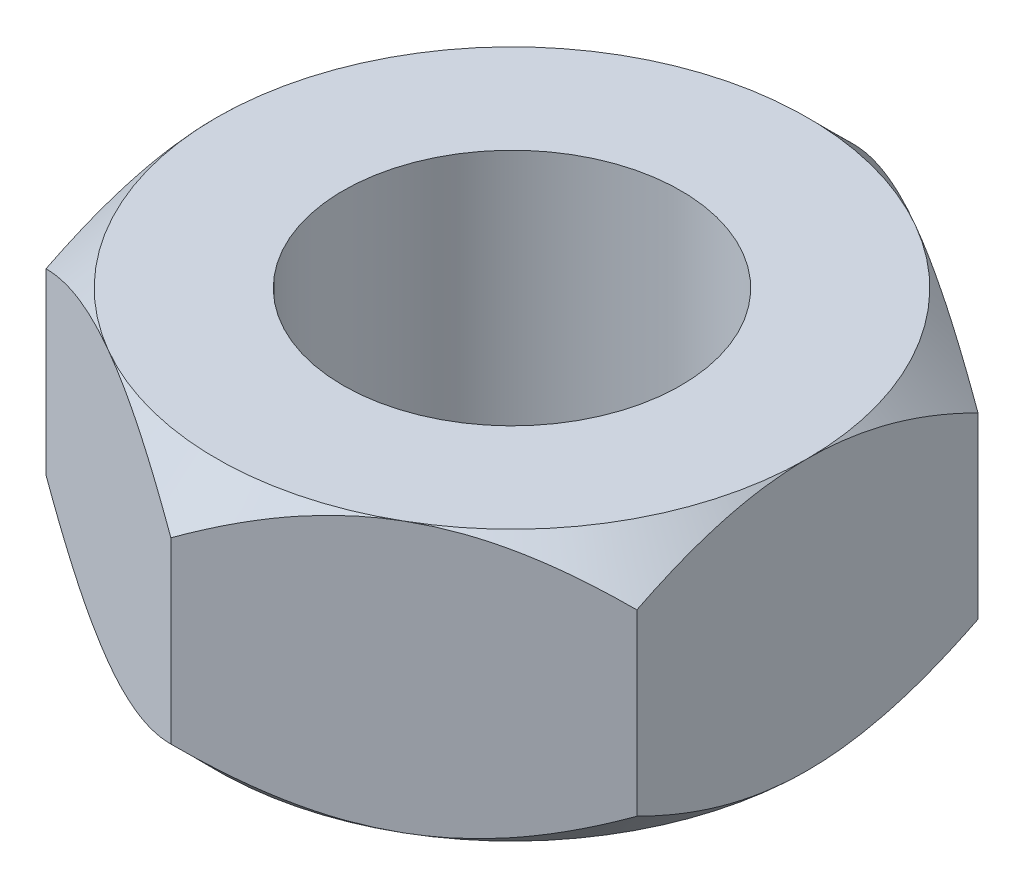
ISO-10303-21;
HEADER;
FILE_DESCRIPTION(('STEP AP214'),'2;1');
FILE_NAME('part.step','',(''),(''),'','','');
FILE_SCHEMA(('AUTOMOTIVE_DESIGN { 1 0 10303 214 1 1 1 1 }'));
ENDSEC;
DATA;
#1=APPLICATION_CONTEXT('core data for automotive mechanical design processes');
#2=APPLICATION_PROTOCOL_DEFINITION('international standard','automotive_design',2000,#1);
#3=PRODUCT_CONTEXT('',#1,'mechanical');
#4=PRODUCT('Part','Part','',(#3));
#5=PRODUCT_RELATED_PRODUCT_CATEGORY('part','',(#4));
#6=PRODUCT_DEFINITION_FORMATION('','',#4);
#7=PRODUCT_DEFINITION_CONTEXT('part definition',#1,'design');
#8=PRODUCT_DEFINITION('design','',#6,#7);
#9=PRODUCT_DEFINITION_SHAPE('','',#8);
#10=(LENGTH_UNIT() NAMED_UNIT(*) SI_UNIT(.MILLI.,.METRE.));
#11=(NAMED_UNIT(*) PLANE_ANGLE_UNIT() SI_UNIT($,.RADIAN.));
#12=(NAMED_UNIT(*) SI_UNIT($,.STERADIAN.) SOLID_ANGLE_UNIT());
#13=UNCERTAINTY_MEASURE_WITH_UNIT(LENGTH_MEASURE(1.E-05),#10,'distance_accuracy_value','');
#14=(GEOMETRIC_REPRESENTATION_CONTEXT(3) GLOBAL_UNCERTAINTY_ASSIGNED_CONTEXT((#13)) GLOBAL_UNIT_ASSIGNED_CONTEXT((#10,
#11,#12)) REPRESENTATION_CONTEXT('',''));
#15=CARTESIAN_POINT('',(0.,0.,0.));
#16=DIRECTION('',(0.,0.,1.));
#17=DIRECTION('',(1.,0.,0.));
#18=AXIS2_PLACEMENT_3D('',#15,#16,#17);
#19=CARTESIAN_POINT('',(3.5,3.2,-2.02072594216369));
#20=DIRECTION('',(-0.5,0.,0.866025403784439));
#21=DIRECTION('',(0.866025403784439,0.,0.5));
#22=AXIS2_PLACEMENT_3D('',#19,#20,#21);
#23=PLANE('',#22);
#24=CARTESIAN_POINT('',(-0.000200000000000032,0.541567359329792,-4.04156735438122));
#25=CARTESIAN_POINT('',(0.120108757817009,0.472167818058705,-3.9721070606697));
#26=CARTESIAN_POINT('',(0.242429214365459,0.406844363182905,-3.90148531215405));
#27=CARTESIAN_POINT('',(0.491853884911907,0.287238936013908,-3.75747991147153));
#28=CARTESIAN_POINT('',(0.618981816842552,0.23302350720677,-3.68408256574985));
#29=CARTESIAN_POINT('',(0.875329162282525,0.140151559561213,-3.53608035685403));
#30=CARTESIAN_POINT('',(1.00448329914368,0.101261624534898,-3.46151318117029));
#31=CARTESIAN_POINT('',(1.26563479388695,0.0413437887204587,-3.31073729538099));
#32=CARTESIAN_POINT('',(1.39762417499828,0.0202711646750029,-3.2345331906662));
#33=CARTESIAN_POINT('',(1.62510370665134,0.00125799897572972,-3.10319782183117));
#34=CARTESIAN_POINT('',(1.72030010780515,-0.00155641581267458,-3.04823615399913));
#35=CARTESIAN_POINT('',(1.91053805112478,0.00318657176732524,-2.93840222621346));
#36=CARTESIAN_POINT('',(2.00557952731162,0.0107476100843944,-2.88353000435281));
#37=CARTESIAN_POINT('',(2.1947620533761,0.0358097805817826,-2.77430542200351));
#38=CARTESIAN_POINT('',(2.2889019761705,0.0533220307074887,-2.71995371223668));
#39=CARTESIAN_POINT('',(2.47556499941577,0.0973307817217027,-2.61218376551827));
#40=CARTESIAN_POINT('',(2.56808822325596,0.123826593791727,-2.55876545732784));
#41=CARTESIAN_POINT('',(2.73234167964216,0.178339853761708,-2.46393368006795));
#42=CARTESIAN_POINT('',(2.80443551971228,0.204924188177154,-2.42231028209655));
#43=CARTESIAN_POINT('',(2.9473289397123,0.262377259290712,-2.33981072759411));
#44=CARTESIAN_POINT('',(3.01812848014492,0.293246126490849,-2.29893459386683));
#45=CARTESIAN_POINT('',(3.15821024645785,0.358576224971511,-2.21805834837751));
#46=CARTESIAN_POINT('',(3.22749645656528,0.393026159978349,-2.17805593632085));
#47=CARTESIAN_POINT('',(3.36478573118621,0.465065984042715,-2.09879193666161));
#48=CARTESIAN_POINT('',(3.43278955208019,0.502653946387927,-2.05952991236255));
#49=CARTESIAN_POINT('',(3.5002,0.541567359329792,-2.02061047210985));
#50=B_SPLINE_CURVE_WITH_KNOTS('',3,(#24,#25,#26,#27,#28,#29,#30,#31,#32,#33,#34,#35,#36,#37,#38,
#39,#40,#41,#42,#43,#44,#45,#46,#47,#48,#49),.UNSPECIFIED.,.F.,.F.,(4,2,2,2,2,2,2,2,2,2,2,2,4),
(0.,0.466195029511834,0.935106055247666,1.3965703522971,1.85687285909025,2.18628459516076,
2.51581179896771,2.845707891424,3.17557869467337,3.43762138891189,3.69967206642681,
3.96091985737577,4.22200840855896),.UNSPECIFIED.);
#51=CARTESIAN_POINT('',(0.,0.541451884327378,-4.04145188432738));
#52=VERTEX_POINT('',#51);
#53=CARTESIAN_POINT('',(1.75,0.,-3.03108891324554));
#54=VERTEX_POINT('',#53);
#55=EDGE_CURVE('E53',#52,#54,#50,.T.);
#56=ORIENTED_EDGE('',*,*,#55,.F.);
#57=DIRECTION('',(0.,-1.,0.));
#58=VECTOR('',#57,1.);
#59=CARTESIAN_POINT('',(0.,3.2,-4.04145188432738));
#60=LINE('',#59,#58);
#61=CARTESIAN_POINT('',(0.,2.65854811567262,-4.04145188432738));
#62=VERTEX_POINT('',#61);
#63=EDGE_CURVE('E279',#62,#52,#60,.T.);
#64=ORIENTED_EDGE('',*,*,#63,.F.);
#65=CARTESIAN_POINT('',(3.5002,2.65843264067021,-2.02061047210985));
#66=CARTESIAN_POINT('',(3.37989124218299,2.7278321819413,-2.09007076582137));
#67=CARTESIAN_POINT('',(3.25757078563454,2.7931556368171,-2.16069251433702));
#68=CARTESIAN_POINT('',(3.00814611508809,2.91276106398609,-2.30469791501954));
#69=CARTESIAN_POINT('',(2.88101818315745,2.96697649279323,-2.37809526074122));
#70=CARTESIAN_POINT('',(2.62467083771747,3.05984844043879,-2.52609746963704));
#71=CARTESIAN_POINT('',(2.49551670085632,3.0987383754651,-2.60066464532078));
#72=CARTESIAN_POINT('',(2.23436520611305,3.15865621127954,-2.75144053111008));
#73=CARTESIAN_POINT('',(2.10237582500172,3.179728835325,-2.82764463582487));
#74=CARTESIAN_POINT('',(1.87489629334865,3.19874200102427,-2.9589800046599));
#75=CARTESIAN_POINT('',(1.77969989219485,3.20155641581267,-3.01394167249194));
#76=CARTESIAN_POINT('',(1.58946194887522,3.19681342823268,-3.12377560027761));
#77=CARTESIAN_POINT('',(1.49442047268838,3.18925238991561,-3.17864782213826));
#78=CARTESIAN_POINT('',(1.3052379466239,3.16419021941822,-3.28787240448756));
#79=CARTESIAN_POINT('',(1.2110980238295,3.14667796929251,-3.34222411425439));
#80=CARTESIAN_POINT('',(1.02443500058423,3.1026692182783,-3.4499940609728));
#81=CARTESIAN_POINT('',(0.931911776744035,3.07617340620827,-3.50341236916323));
#82=CARTESIAN_POINT('',(0.767658320357844,3.02166014623829,-3.59824414642312));
#83=CARTESIAN_POINT('',(0.69556448028772,2.99507581182285,-3.63986754439452));
#84=CARTESIAN_POINT('',(0.552671060287704,2.93762274070929,-3.72236709889696));
#85=CARTESIAN_POINT('',(0.481871519855081,2.90675387350915,-3.76324323262424));
#86=CARTESIAN_POINT('',(0.341789753542154,2.84142377502849,-3.84411947811356));
#87=CARTESIAN_POINT('',(0.272503543434723,2.80697384002165,-3.88412189017022));
#88=CARTESIAN_POINT('',(0.135214268813787,2.73493401595729,-3.96338588982946));
#89=CARTESIAN_POINT('',(0.0672104479198104,2.69734605361207,-4.00264791412852));
#90=CARTESIAN_POINT('',(-0.000200000000000218,2.65843264067021,-4.04156735438122));
#91=B_SPLINE_CURVE_WITH_KNOTS('',3,(#65,#66,#67,#68,#69,#70,#71,#72,#73,#74,#75,#76,#77,#78,#79,
#80,#81,#82,#83,#84,#85,#86,#87,#88,#89,#90),.UNSPECIFIED.,.F.,.F.,(4,2,2,2,2,2,2,2,2,2,2,2,4),
(0.,0.466195029511834,0.935106055247667,1.3965703522971,1.85687285909025,2.18628459516076,
2.51581179896771,2.845707891424,3.17557869467337,3.43762138891189,3.69967206642681,
3.96091985737577,4.22200840855896),.UNSPECIFIED.);
#92=CARTESIAN_POINT('',(1.75,3.2,-3.03108891324553));
#93=VERTEX_POINT('',#92);
#94=EDGE_CURVE('E251',#93,#62,#91,.T.);
#95=ORIENTED_EDGE('',*,*,#94,.F.);
#96=CARTESIAN_POINT('',(3.5,2.65854811567262,-2.02072594216369));
#97=VERTEX_POINT('',#96);
#98=EDGE_CURVE('E319',#97,#93,#91,.T.);
#99=ORIENTED_EDGE('',*,*,#98,.F.);
#100=DIRECTION('',(0.,-1.,0.));
#101=VECTOR('',#100,1.);
#102=CARTESIAN_POINT('',(3.5,3.2,-2.02072594216369));
#103=LINE('',#102,#101);
#104=CARTESIAN_POINT('',(3.5,0.541451884327378,-2.02072594216369));
#105=VERTEX_POINT('',#104);
#106=EDGE_CURVE('E321',#97,#105,#103,.T.);
#107=ORIENTED_EDGE('',*,*,#106,.T.);
#108=EDGE_CURVE('E138',#54,#105,#50,.T.);
#109=ORIENTED_EDGE('',*,*,#108,.F.);
#110=EDGE_LOOP('',(#56,#64,#95,#99,#107,#109));
#111=FACE_BOUND('',#110,.T.);
#112=ADVANCED_FACE('F37',(#111),#23,.F.);
#113=CARTESIAN_POINT('',(0.,3.2,-4.04145188432738));
#114=DIRECTION('',(0.5,0.,0.866025403784439));
#115=DIRECTION('',(0.866025403784439,0.,-0.5));
#116=AXIS2_PLACEMENT_3D('',#113,#114,#115);
#117=PLANE('',#116);
#118=CARTESIAN_POINT('',(-3.5002,0.541567359329791,-2.02061047210985));
#119=CARTESIAN_POINT('',(-3.37989124218299,0.472167818058704,-2.09007076582137));
#120=CARTESIAN_POINT('',(-3.25757078563454,0.406844363182905,-2.16069251433702));
#121=CARTESIAN_POINT('',(-3.00814611508809,0.287238936013908,-2.30469791501954));
#122=CARTESIAN_POINT('',(-2.88101818315745,0.23302350720677,-2.37809526074122));
#123=CARTESIAN_POINT('',(-2.62467083771747,0.140151559561213,-2.52609746963704));
#124=CARTESIAN_POINT('',(-2.49551670085632,0.101261624534898,-2.60066464532078));
#125=CARTESIAN_POINT('',(-2.23436520611305,0.0413437887204588,-2.75144053111008));
#126=CARTESIAN_POINT('',(-2.10237582500172,0.0202711646750032,-2.82764463582487));
#127=CARTESIAN_POINT('',(-1.87489629334865,0.00125799897572986,-2.9589800046599));
#128=CARTESIAN_POINT('',(-1.77969989219485,-0.00155641581267468,-3.01394167249194));
#129=CARTESIAN_POINT('',(-1.58946194887522,0.0031865717673249,-3.12377560027761));
#130=CARTESIAN_POINT('',(-1.49442047268838,0.010747610084394,-3.17864782213826));
#131=CARTESIAN_POINT('',(-1.3052379466239,0.0358097805817824,-3.28787240448756));
#132=CARTESIAN_POINT('',(-1.2110980238295,0.0533220307074888,-3.34222411425439));
#133=CARTESIAN_POINT('',(-1.02443500058423,0.0973307817217029,-3.4499940609728));
#134=CARTESIAN_POINT('',(-0.931911776744036,0.123826593791727,-3.50341236916323));
#135=CARTESIAN_POINT('',(-0.767658320357844,0.178339853761709,-3.59824414642312));
#136=CARTESIAN_POINT('',(-0.69556448028772,0.204924188177154,-3.63986754439452));
#137=CARTESIAN_POINT('',(-0.552671060287704,0.262377259290712,-3.72236709889696));
#138=CARTESIAN_POINT('',(-0.481871519855081,0.293246126490849,-3.76324323262424));
#139=CARTESIAN_POINT('',(-0.341789753542154,0.358576224971512,-3.84411947811356));
#140=CARTESIAN_POINT('',(-0.272503543434723,0.393026159978349,-3.88412189017022));
#141=CARTESIAN_POINT('',(-0.135214268813787,0.465065984042715,-3.96338588982946));
#142=CARTESIAN_POINT('',(-0.0672104479198102,0.502653946387927,-4.00264791412852));
#143=CARTESIAN_POINT('',(0.00019999999999989,0.541567359329791,-4.04156735438122));
#144=B_SPLINE_CURVE_WITH_KNOTS('',3,(#118,#119,#120,#121,#122,#123,#124,#125,#126,#127,#128,
#129,#130,#131,#132,#133,#134,#135,#136,#137,#138,#139,#140,#141,#142,#143),.UNSPECIFIED.,.F.,
.F.,(4,2,2,2,2,2,2,2,2,2,2,2,4),(0.,0.466195029511834,0.935106055247666,1.3965703522971,
1.85687285909025,2.18628459516076,2.51581179896771,2.845707891424,3.17557869467337,
3.43762138891189,3.69967206642681,3.96091985737577,4.22200840855895),.UNSPECIFIED.);
#145=CARTESIAN_POINT('',(-3.5,0.541451884327377,-2.02072594216369));
#146=VERTEX_POINT('',#145);
#147=CARTESIAN_POINT('',(-1.75,0.,-3.03108891324554));
#148=VERTEX_POINT('',#147);
#149=EDGE_CURVE('E61',#146,#148,#144,.T.);
#150=ORIENTED_EDGE('',*,*,#149,.F.);
#151=DIRECTION('',(0.,-1.,0.));
#152=VECTOR('',#151,1.);
#153=CARTESIAN_POINT('',(-3.5,3.2,-2.02072594216369));
#154=LINE('',#153,#152);
#155=CARTESIAN_POINT('',(-3.5,2.65854811567262,-2.02072594216369));
#156=VERTEX_POINT('',#155);
#157=EDGE_CURVE('E272',#156,#146,#154,.T.);
#158=ORIENTED_EDGE('',*,*,#157,.F.);
#159=CARTESIAN_POINT('',(0.000199999999999968,2.65843264067021,-4.04156735438122));
#160=CARTESIAN_POINT('',(-0.12010875781701,2.7278321819413,-3.9721070606697));
#161=CARTESIAN_POINT('',(-0.24242921436546,2.7931556368171,-3.90148531215405));
#162=CARTESIAN_POINT('',(-0.491853884911907,2.91276106398609,-3.75747991147153));
#163=CARTESIAN_POINT('',(-0.618981816842553,2.96697649279323,-3.68408256574985));
#164=CARTESIAN_POINT('',(-0.875329162282526,3.05984844043879,-3.53608035685403));
#165=CARTESIAN_POINT('',(-1.00448329914368,3.0987383754651,-3.46151318117029));
#166=CARTESIAN_POINT('',(-1.26563479388695,3.15865621127954,-3.31073729538099));
#167=CARTESIAN_POINT('',(-1.39762417499828,3.179728835325,-3.2345331906662));
#168=CARTESIAN_POINT('',(-1.62510370665135,3.19874200102427,-3.10319782183117));
#169=CARTESIAN_POINT('',(-1.72030010780515,3.20155641581267,-3.04823615399913));
#170=CARTESIAN_POINT('',(-1.91053805112478,3.19681342823268,-2.93840222621346));
#171=CARTESIAN_POINT('',(-2.00557952731162,3.18925238991561,-2.88353000435281));
#172=CARTESIAN_POINT('',(-2.1947620533761,3.16419021941822,-2.77430542200351));
#173=CARTESIAN_POINT('',(-2.2889019761705,3.14667796929251,-2.71995371223668));
#174=CARTESIAN_POINT('',(-2.47556499941577,3.1026692182783,-2.61218376551827));
#175=CARTESIAN_POINT('',(-2.56808822325596,3.07617340620827,-2.55876545732784));
#176=CARTESIAN_POINT('',(-2.73234167964216,3.02166014623829,-2.46393368006795));
#177=CARTESIAN_POINT('',(-2.80443551971228,2.99507581182285,-2.42231028209655));
#178=CARTESIAN_POINT('',(-2.9473289397123,2.93762274070929,-2.33981072759411));
#179=CARTESIAN_POINT('',(-3.01812848014492,2.90675387350915,-2.29893459386684));
#180=CARTESIAN_POINT('',(-3.15821024645785,2.84142377502849,-2.21805834837751));
#181=CARTESIAN_POINT('',(-3.22749645656528,2.80697384002165,-2.17805593632085));
#182=CARTESIAN_POINT('',(-3.36478573118621,2.73493401595729,-2.09879193666161));
#183=CARTESIAN_POINT('',(-3.43278955208019,2.69734605361207,-2.05952991236255));
#184=CARTESIAN_POINT('',(-3.5002,2.65843264067021,-2.02061047210985));
#185=B_SPLINE_CURVE_WITH_KNOTS('',3,(#159,#160,#161,#162,#163,#164,#165,#166,#167,#168,#169,
#170,#171,#172,#173,#174,#175,#176,#177,#178,#179,#180,#181,#182,#183,#184),.UNSPECIFIED.,.F.,
.F.,(4,2,2,2,2,2,2,2,2,2,2,2,4),(0.,0.466195029511834,0.935106055247666,1.3965703522971,
1.85687285909025,2.18628459516076,2.51581179896771,2.845707891424,3.17557869467337,
3.43762138891189,3.69967206642681,3.96091985737577,4.22200840855895),.UNSPECIFIED.);
#186=CARTESIAN_POINT('',(-1.75,3.2,-3.03108891324554));
#187=VERTEX_POINT('',#186);
#188=EDGE_CURVE('E244',#187,#156,#185,.T.);
#189=ORIENTED_EDGE('',*,*,#188,.F.);
#190=EDGE_CURVE('E250',#62,#187,#185,.T.);
#191=ORIENTED_EDGE('',*,*,#190,.F.);
#192=ORIENTED_EDGE('',*,*,#63,.T.);
#193=EDGE_CURVE('E161',#148,#52,#144,.T.);
#194=ORIENTED_EDGE('',*,*,#193,.F.);
#195=EDGE_LOOP('',(#150,#158,#189,#191,#192,#194));
#196=FACE_BOUND('',#195,.T.);
#197=ADVANCED_FACE('F257',(#196),#117,.F.);
#198=CARTESIAN_POINT('',(-3.5,3.2,-2.02072594216369));
#199=DIRECTION('',(1.,0.,0.));
#200=DIRECTION('',(0.,0.,-1.));
#201=AXIS2_PLACEMENT_3D('',#198,#199,#200);
#202=PLANE('',#201);
#203=CARTESIAN_POINT('',(-3.5,2.3256713613337,-4.65708565631595));
#204=CARTESIAN_POINT('',(-3.5,2.23693484652521,-4.54605882123062));
#205=CARTESIAN_POINT('',(-3.5,2.14887090968388,-4.43448654134824));
#206=CARTESIAN_POINT('',(-3.5,1.97440855948707,-4.21001148832555));
#207=CARTESIAN_POINT('',(-3.5,1.8880104951236,-4.09710844421042));
#208=CARTESIAN_POINT('',(-3.5,1.71659247906892,-3.86891969947486));
#209=CARTESIAN_POINT('',(-3.5,1.6315878625242,-3.75362244416701));
#210=CARTESIAN_POINT('',(-3.5,1.46411276747994,-3.5212089086507));
#211=CARTESIAN_POINT('',(-3.5,1.38164212124806,-3.40409274961775));
#212=CARTESIAN_POINT('',(-3.5,1.21347850124854,-3.15840577561383));
#213=CARTESIAN_POINT('',(-3.5,1.12804215409372,-3.02965845019719));
#214=CARTESIAN_POINT('',(-3.5,0.961839927544366,-2.76913075627476));
#215=CARTESIAN_POINT('',(-3.5,0.881074935502758,-2.63734981811848));
#216=CARTESIAN_POINT('',(-3.5,0.725880660750951,-2.37061231363761));
#217=CARTESIAN_POINT('',(-3.5,0.651433029692362,-2.23566650641799));
#218=CARTESIAN_POINT('',(-3.5,0.510540913332971,-1.96169202647091));
#219=CARTESIAN_POINT('',(-3.5,0.444092341180628,-1.82266548420907));
#220=CARTESIAN_POINT('',(-3.5,0.329881795571819,-1.55889748080903));
#221=CARTESIAN_POINT('',(-3.5,0.280809322715316,-1.43472920163482));
#222=CARTESIAN_POINT('',(-3.5,0.192590886435105,-1.18284805675252));
#223=CARTESIAN_POINT('',(-3.5,0.153445483952302,-1.05513499119425));
#224=CARTESIAN_POINT('',(-3.5,0.088054187186869,-0.799407030471417));
#225=CARTESIAN_POINT('',(-3.5,0.0615415390577794,-0.671461605423027));
#226=CARTESIAN_POINT('',(-3.5,0.0220391657622304,-0.413487989194825));
#227=CARTESIAN_POINT('',(-3.5,0.00904522403360878,-0.283460460291332));
#228=CARTESIAN_POINT('',(-3.5,-0.00198267855047568,-0.031174644961277));
#229=CARTESIAN_POINT('',(-3.5,-0.000927611911365244,0.0910437347952603));
#230=CARTESIAN_POINT('',(-3.5,0.0138629369262191,0.334704869387154));
#231=CARTESIAN_POINT('',(-3.5,0.0275993496135092,0.456147566648704));
#232=CARTESIAN_POINT('',(-3.5,0.0671475233308929,0.699464534325656));
#233=CARTESIAN_POINT('',(-3.5,0.0931913833776037,0.821300347334137));
#234=CARTESIAN_POINT('',(-3.5,0.155778228344611,1.06219651791286));
#235=CARTESIAN_POINT('',(-3.5,0.192321339435735,1.18125684211112));
#236=CARTESIAN_POINT('',(-3.5,0.27392359392188,1.41582104114396));
#237=CARTESIAN_POINT('',(-3.5,0.318946484713345,1.53133770662921));
#238=CARTESIAN_POINT('',(-3.5,0.415975037634169,1.7594085553698));
#239=CARTESIAN_POINT('',(-3.5,0.467982791200252,1.87196183919744));
#240=CARTESIAN_POINT('',(-3.5,0.577756425241606,2.09463867445396));
#241=CARTESIAN_POINT('',(-3.5,0.635539795745167,2.20475353164179));
#242=CARTESIAN_POINT('',(-3.5,0.755598090655608,2.42246972096599));
#243=CARTESIAN_POINT('',(-3.5,0.817872353800752,2.53007142007605));
#244=CARTESIAN_POINT('',(-3.5,0.942869681058982,2.73781420943154));
#245=CARTESIAN_POINT('',(-3.5,1.00541802426334,2.83806098843638));
#246=CARTESIAN_POINT('',(-3.5,1.13320165659201,3.03683217418529));
#247=CARTESIAN_POINT('',(-3.5,1.19843714277252,3.135356453856));
#248=CARTESIAN_POINT('',(-3.5,1.33059616548375,3.33012697439862));
#249=CARTESIAN_POINT('',(-3.5,1.39750231040578,3.42638505880411));
#250=CARTESIAN_POINT('',(-3.5,1.53312737620992,3.61757732085831));
#251=CARTESIAN_POINT('',(-3.5,1.60184579373115,3.71251185515599));
#252=CARTESIAN_POINT('',(-3.5,1.67130677466893,3.80689030019737));
#253=B_SPLINE_CURVE_WITH_KNOTS('',3,(#203,#204,#205,#206,#207,#208,#209,#210,#211,#212,#213,
#214,#215,#216,#217,#218,#219,#220,#221,#222,#223,#224,#225,#226,#227,#228,#229,#230,#231,#232,
#233,#234,#235,#236,#237,#238,#239,#240,#241,#242,#243,#244,#245,#246,#247,#248,#249,#250,#251,
#252),.UNSPECIFIED.,.F.,.F.,(4,2,2,2,2,2,2,2,2,2,2,2,2,2,2,2,2,2,2,2,2,2,2,2,4),(0.,
0.426398539880529,0.852885458296334,1.28259322568792,1.71227248767526,2.17574222881015,
2.63929972169932,3.1014611455685,3.56338543223046,3.96359280346659,4.36382278385926,
4.7551792331046,5.14641357939725,5.51241001802145,5.87843331362606,6.25165284952876,
6.62487687064538,6.99654009219769,7.36831484784204,7.74125165756744,8.11413366587499,
8.46856265255045,8.82301767699229,9.1746745063842,9.5262346705107),.UNSPECIFIED.);
#254=CARTESIAN_POINT('',(-3.5,0.541451884327378,2.02072594216369));
#255=VERTEX_POINT('',#254);
#256=CARTESIAN_POINT('',(-3.5,0.,0.));
#257=VERTEX_POINT('',#256);
#258=EDGE_CURVE('E348',#255,#257,#253,.F.);
#259=ORIENTED_EDGE('',*,*,#258,.F.);
#260=DIRECTION('',(0.,-1.,0.));
#261=VECTOR('',#260,1.);
#262=CARTESIAN_POINT('',(-3.5,3.2,2.02072594216369));
#263=LINE('',#262,#261);
#264=CARTESIAN_POINT('',(-3.5,2.65854811567262,2.02072594216369));
#265=VERTEX_POINT('',#264);
#266=EDGE_CURVE('E280',#265,#255,#263,.T.);
#267=ORIENTED_EDGE('',*,*,#266,.F.);
#268=CARTESIAN_POINT('',(-3.5,0.88654055203975,-4.64180037841767));
#269=CARTESIAN_POINT('',(-3.5,0.97491284896177,-4.53109765367925));
#270=CARTESIAN_POINT('',(-3.5,1.06261158069899,-4.41984931001927));
#271=CARTESIAN_POINT('',(-3.5,1.23634150113607,-4.19602224862235));
#272=CARTESIAN_POINT('',(-3.5,1.32237233888058,-4.0834432587454));
#273=CARTESIAN_POINT('',(-3.5,1.49305165943238,-3.85590490603815));
#274=CARTESIAN_POINT('',(-3.5,1.57768477657333,-3.74093398236547));
#275=CARTESIAN_POINT('',(-3.5,1.74441489868652,-3.50917463452194));
#276=CARTESIAN_POINT('',(-3.5,1.82651207167752,-3.39238633153573));
#277=CARTESIAN_POINT('',(-3.5,1.99385403359336,-3.14744791151355));
#278=CARTESIAN_POINT('',(-3.5,2.07884391040621,-3.01912278580678));
#279=CARTESIAN_POINT('',(-3.5,2.24415806546319,-2.75944910809818));
#280=CARTESIAN_POINT('',(-3.5,2.32448146062927,-2.62809999036472));
#281=CARTESIAN_POINT('',(-3.5,2.47880461233327,-2.36223971960897));
#282=CARTESIAN_POINT('',(-3.5,2.55282269427046,-2.22773928720062));
#283=CARTESIAN_POINT('',(-3.5,2.69287731742759,-1.95467727577191));
#284=CARTESIAN_POINT('',(-3.5,2.75891792464889,-1.81611781070944));
#285=CARTESIAN_POINT('',(-3.5,2.87246881769668,-1.55310167296275));
#286=CARTESIAN_POINT('',(-3.5,2.92127499861193,-1.4292101314495));
#287=CARTESIAN_POINT('',(-3.5,3.00898344176643,-1.17790302005924));
#288=CARTESIAN_POINT('',(-3.5,3.04788514325257,-1.05048725110674));
#289=CARTESIAN_POINT('',(-3.5,3.11283766732771,-0.795357468257121));
#290=CARTESIAN_POINT('',(-3.5,3.13915307790868,-0.667712055060811));
#291=CARTESIAN_POINT('',(-3.5,3.17831637460429,-0.410359824096871));
#292=CARTESIAN_POINT('',(-3.5,3.19116840361244,-0.280653652935948));
#293=CARTESIAN_POINT('',(-3.5,3.20199524864544,-0.02889971996186));
#294=CARTESIAN_POINT('',(-3.5,3.2008657915724,0.0931094424805183));
#295=CARTESIAN_POINT('',(-3.5,3.18597272839318,0.336348292547735));
#296=CARTESIAN_POINT('',(-3.5,3.17220818735697,0.457577921822735));
#297=CARTESIAN_POINT('',(-3.5,3.13264918567704,0.700461358627822));
#298=CARTESIAN_POINT('',(-3.5,3.10662417819007,0.822076890317912));
#299=CARTESIAN_POINT('',(-3.5,3.04411477391023,1.06254130713413));
#300=CARTESIAN_POINT('',(-3.5,3.00763027768291,1.18139016594691));
#301=CARTESIAN_POINT('',(-3.5,2.92610536192996,1.41574354700838));
#302=CARTESIAN_POINT('',(-3.5,2.88108634397598,1.53125561915142));
#303=CARTESIAN_POINT('',(-3.5,2.78406578849256,1.75931751297324));
#304=CARTESIAN_POINT('',(-3.5,2.73206215623371,1.87186643382633));
#305=CARTESIAN_POINT('',(-3.5,2.62229674710328,2.0945350527037));
#306=CARTESIAN_POINT('',(-3.5,2.56451746389042,2.20464604876977));
#307=CARTESIAN_POINT('',(-3.5,2.44446739703162,2.4223546066353));
#308=CARTESIAN_POINT('',(-3.5,2.38219727520798,2.52995253570806));
#309=CARTESIAN_POINT('',(-3.5,2.25720630681351,2.73769092059249));
#310=CARTESIAN_POINT('',(-3.5,2.19466008761038,2.83793700536439));
#311=CARTESIAN_POINT('',(-3.5,2.06688055877528,3.03670675903215));
#312=CARTESIAN_POINT('',(-3.5,2.00164705193115,3.13523030075717));
#313=CARTESIAN_POINT('',(-3.5,1.86949204533226,3.32999902812677));
#314=CARTESIAN_POINT('',(-3.5,1.80258794429926,3.42625606189975));
#315=CARTESIAN_POINT('',(-3.5,1.66696688730493,3.61744618024036));
#316=CARTESIAN_POINT('',(-3.5,1.59825043486873,3.71237962156677));
#317=CARTESIAN_POINT('',(-3.5,1.52879138590465,3.80675695710851));
#318=B_SPLINE_CURVE_WITH_KNOTS('',3,(#268,#269,#270,#271,#272,#273,#274,#275,#276,#277,#278,
#279,#280,#281,#282,#283,#284,#285,#286,#287,#288,#289,#290,#291,#292,#293,#294,#295,#296,#297,
#298,#299,#300,#301,#302,#303,#304,#305,#306,#307,#308,#309,#310,#311,#312,#313,#314,#315,#316,
#317),.UNSPECIFIED.,.F.,.F.,(4,2,2,2,2,2,2,2,2,2,2,2,2,2,2,2,2,2,2,2,2,2,2,2,4),(0.,
0.424956907062997,0.850002283015271,1.27826069957822,1.70649068078967,2.16816454630224,
2.62992549560274,3.09029504328599,3.55042894838405,3.94957138389257,4.3487364122709,
4.73909482523258,5.12933308347694,5.49470732908934,5.86010861266111,6.23267329435252,
6.60524151799441,6.9768875426946,7.34864527628005,7.72156612045126,8.09443211852644,
8.44885595869814,8.80330585549657,9.15495659495157,9.50651064368479),.UNSPECIFIED.);
#319=CARTESIAN_POINT('',(-3.5,3.2,0.));
#320=VERTEX_POINT('',#319);
#321=EDGE_CURVE('E237',#320,#265,#318,.T.);
#322=ORIENTED_EDGE('',*,*,#321,.F.);
#323=EDGE_CURVE('E243',#156,#320,#318,.T.);
#324=ORIENTED_EDGE('',*,*,#323,.F.);
#325=ORIENTED_EDGE('',*,*,#157,.T.);
#326=EDGE_CURVE('E196',#257,#146,#253,.F.);
#327=ORIENTED_EDGE('',*,*,#326,.F.);
#328=EDGE_LOOP('',(#259,#267,#322,#324,#325,#327));
#329=FACE_BOUND('',#328,.T.);
#330=ADVANCED_FACE('F218',(#329),#202,.F.);
#331=CARTESIAN_POINT('',(-3.5,3.2,2.02072594216369));
#332=DIRECTION('',(0.5,0.,-0.866025403784439));
#333=DIRECTION('',(-0.866025403784439,0.,-0.5));
#334=AXIS2_PLACEMENT_3D('',#331,#332,#333);
#335=PLANE('',#334);
#336=CARTESIAN_POINT('',(0.000200000000000371,0.541567359329791,4.04156735438122));
#337=CARTESIAN_POINT('',(-0.120108757817009,0.472167818058703,3.9721070606697));
#338=CARTESIAN_POINT('',(-0.242429214365459,0.406844363182904,3.90148531215405));
#339=CARTESIAN_POINT('',(-0.491853884911907,0.287238936013908,3.75747991147153));
#340=CARTESIAN_POINT('',(-0.618981816842552,0.23302350720677,3.68408256574985));
#341=CARTESIAN_POINT('',(-0.875329162282526,0.140151559561212,3.53608035685403));
#342=CARTESIAN_POINT('',(-1.00448329914368,0.101261624534897,3.46151318117029));
#343=CARTESIAN_POINT('',(-1.26563479388695,0.0413437887204571,3.31073729538099));
#344=CARTESIAN_POINT('',(-1.39762417499828,0.0202711646750016,3.23453319066619));
#345=CARTESIAN_POINT('',(-1.62510370665135,0.00125799897572877,3.10319782183117));
#346=CARTESIAN_POINT('',(-1.72030010780515,-0.00155641581267543,3.04823615399913));
#347=CARTESIAN_POINT('',(-1.91053805112478,0.00318657176732456,2.93840222621346));
#348=CARTESIAN_POINT('',(-2.00557952731162,0.0107476100843938,2.88353000435281));
#349=CARTESIAN_POINT('',(-2.1947620533761,0.0358097805817821,2.77430542200351));
#350=CARTESIAN_POINT('',(-2.2889019761705,0.0533220307074883,2.71995371223668));
#351=CARTESIAN_POINT('',(-2.47556499941577,0.0973307817217025,2.61218376551827));
#352=CARTESIAN_POINT('',(-2.56808822325597,0.123826593791727,2.55876545732784));
#353=CARTESIAN_POINT('',(-2.73234167964216,0.178339853761708,2.46393368006795));
#354=CARTESIAN_POINT('',(-2.80443551971228,0.204924188177154,2.42231028209655));
#355=CARTESIAN_POINT('',(-2.9473289397123,0.262377259290712,2.33981072759411));
#356=CARTESIAN_POINT('',(-3.01812848014492,0.293246126490849,2.29893459386683));
#357=CARTESIAN_POINT('',(-3.15821024645785,0.358576224971511,2.21805834837751));
#358=CARTESIAN_POINT('',(-3.22749645656528,0.393026159978348,2.17805593632085));
#359=CARTESIAN_POINT('',(-3.36478573118621,0.465065984042714,2.09879193666161));
#360=CARTESIAN_POINT('',(-3.43278955208019,0.502653946387926,2.05952991236255));
#361=CARTESIAN_POINT('',(-3.5002,0.541567359329791,2.02061047210985));
#362=B_SPLINE_CURVE_WITH_KNOTS('',3,(#336,#337,#338,#339,#340,#341,#342,#343,#344,#345,#346,
#347,#348,#349,#350,#351,#352,#353,#354,#355,#356,#357,#358,#359,#360,#361),.UNSPECIFIED.,.F.,
.F.,(4,2,2,2,2,2,2,2,2,2,2,2,4),(0.,0.466195029511834,0.935106055247667,1.3965703522971,
1.85687285909025,2.18628459516076,2.51581179896771,2.845707891424,3.17557869467337,
3.43762138891189,3.69967206642681,3.96091985737577,4.22200840855896),.UNSPECIFIED.);
#363=CARTESIAN_POINT('',(0.,0.541451884327377,4.04145188432738));
#364=VERTEX_POINT('',#363);
#365=CARTESIAN_POINT('',(-1.75,0.,3.03108891324554));
#366=VERTEX_POINT('',#365);
#367=EDGE_CURVE('E147',#364,#366,#362,.T.);
#368=ORIENTED_EDGE('',*,*,#367,.F.);
#369=DIRECTION('',(0.,-1.,0.));
#370=VECTOR('',#369,1.);
#371=CARTESIAN_POINT('',(0.,3.2,4.04145188432738));
#372=LINE('',#371,#370);
#373=CARTESIAN_POINT('',(0.,2.65854811567262,4.04145188432738));
#374=VERTEX_POINT('',#373);
#375=EDGE_CURVE('E160',#374,#364,#372,.T.);
#376=ORIENTED_EDGE('',*,*,#375,.F.);
#377=CARTESIAN_POINT('',(-3.5002,2.65843264067021,2.02061047210985));
#378=CARTESIAN_POINT('',(-3.37989124218299,2.7278321819413,2.09007076582137));
#379=CARTESIAN_POINT('',(-3.25757078563454,2.7931556368171,2.16069251433702));
#380=CARTESIAN_POINT('',(-3.00814611508809,2.91276106398609,2.30469791501954));
#381=CARTESIAN_POINT('',(-2.88101818315745,2.96697649279323,2.37809526074122));
#382=CARTESIAN_POINT('',(-2.62467083771747,3.05984844043879,2.52609746963703));
#383=CARTESIAN_POINT('',(-2.49551670085632,3.0987383754651,2.60066464532078));
#384=CARTESIAN_POINT('',(-2.23436520611305,3.15865621127954,2.75144053111008));
#385=CARTESIAN_POINT('',(-2.10237582500172,3.179728835325,2.82764463582487));
#386=CARTESIAN_POINT('',(-1.87489629334865,3.19874200102427,2.9589800046599));
#387=CARTESIAN_POINT('',(-1.77969989219485,3.20155641581268,3.01394167249194));
#388=CARTESIAN_POINT('',(-1.58946194887522,3.19681342823268,3.12377560027761));
#389=CARTESIAN_POINT('',(-1.49442047268838,3.18925238991561,3.17864782213826));
#390=CARTESIAN_POINT('',(-1.3052379466239,3.16419021941822,3.28787240448756));
#391=CARTESIAN_POINT('',(-1.2110980238295,3.14667796929251,3.34222411425439));
#392=CARTESIAN_POINT('',(-1.02443500058423,3.1026692182783,3.4499940609728));
#393=CARTESIAN_POINT('',(-0.931911776744035,3.07617340620827,3.50341236916323));
#394=CARTESIAN_POINT('',(-0.767658320357843,3.02166014623829,3.59824414642312));
#395=CARTESIAN_POINT('',(-0.695564480287719,2.99507581182285,3.63986754439452));
#396=CARTESIAN_POINT('',(-0.552671060287703,2.93762274070929,3.72236709889696));
#397=CARTESIAN_POINT('',(-0.481871519855081,2.90675387350915,3.76324323262423));
#398=CARTESIAN_POINT('',(-0.341789753542154,2.84142377502849,3.84411947811356));
#399=CARTESIAN_POINT('',(-0.272503543434723,2.80697384002165,3.88412189017021));
#400=CARTESIAN_POINT('',(-0.135214268813786,2.73493401595729,3.96338588982946));
#401=CARTESIAN_POINT('',(-0.0672104479198097,2.69734605361207,4.00264791412852));
#402=CARTESIAN_POINT('',(0.000200000000000818,2.65843264067021,4.04156735438122));
#403=B_SPLINE_CURVE_WITH_KNOTS('',3,(#377,#378,#379,#380,#381,#382,#383,#384,#385,#386,#387,
#388,#389,#390,#391,#392,#393,#394,#395,#396,#397,#398,#399,#400,#401,#402),.UNSPECIFIED.,.F.,
.F.,(4,2,2,2,2,2,2,2,2,2,2,2,4),(0.,0.466195029511834,0.935106055247666,1.3965703522971,
1.85687285909025,2.18628459516076,2.51581179896771,2.845707891424,3.17557869467337,
3.43762138891189,3.69967206642681,3.96091985737577,4.22200840855896),.UNSPECIFIED.);
#404=CARTESIAN_POINT('',(-1.75,3.2,3.03108891324554));
#405=VERTEX_POINT('',#404);
#406=EDGE_CURVE('E223',#405,#374,#403,.T.);
#407=ORIENTED_EDGE('',*,*,#406,.F.);
#408=EDGE_CURVE('E230',#265,#405,#403,.T.);
#409=ORIENTED_EDGE('',*,*,#408,.F.);
#410=ORIENTED_EDGE('',*,*,#266,.T.);
#411=EDGE_CURVE('E163',#366,#255,#362,.T.);
#412=ORIENTED_EDGE('',*,*,#411,.F.);
#413=EDGE_LOOP('',(#368,#376,#407,#409,#410,#412));
#414=FACE_BOUND('',#413,.T.);
#415=ADVANCED_FACE('F215',(#414),#335,.F.);
#416=CARTESIAN_POINT('',(0.,3.2,4.04145188432738));
#417=DIRECTION('',(-0.5,0.,-0.866025403784439));
#418=DIRECTION('',(-0.866025403784439,0.,0.5));
#419=AXIS2_PLACEMENT_3D('',#416,#417,#418);
#420=PLANE('',#419);
#421=CARTESIAN_POINT('',(3.5002,0.541567359329792,2.02061047210985));
#422=CARTESIAN_POINT('',(3.37989124218299,0.472167818058705,2.09007076582137));
#423=CARTESIAN_POINT('',(3.25757078563454,0.406844363182906,2.16069251433702));
#424=CARTESIAN_POINT('',(3.00814611508809,0.287238936013909,2.30469791501954));
#425=CARTESIAN_POINT('',(2.88101818315745,0.233023507206771,2.37809526074122));
#426=CARTESIAN_POINT('',(2.62467083771748,0.140151559561214,2.52609746963704));
#427=CARTESIAN_POINT('',(2.49551670085632,0.101261624534898,2.60066464532078));
#428=CARTESIAN_POINT('',(2.23436520611305,0.0413437887204588,2.75144053111008));
#429=CARTESIAN_POINT('',(2.10237582500172,0.0202711646750031,2.82764463582487));
#430=CARTESIAN_POINT('',(1.87489629334866,0.00125799897572997,2.9589800046599));
#431=CARTESIAN_POINT('',(1.77969989219485,-0.0015564158126743,3.01394167249194));
#432=CARTESIAN_POINT('',(1.58946194887522,0.00318657176732518,3.12377560027761));
#433=CARTESIAN_POINT('',(1.49442047268838,0.010747610084394,3.17864782213826));
#434=CARTESIAN_POINT('',(1.3052379466239,0.0358097805817821,3.28787240448756));
#435=CARTESIAN_POINT('',(1.21109802382951,0.0533220307074884,3.34222411425439));
#436=CARTESIAN_POINT('',(1.02443500058423,0.0973307817217021,3.4499940609728));
#437=CARTESIAN_POINT('',(0.931911776744037,0.123826593791726,3.50341236916323));
#438=CARTESIAN_POINT('',(0.767658320357846,0.178339853761707,3.59824414642312));
#439=CARTESIAN_POINT('',(0.695564480287721,0.204924188177153,3.63986754439452));
#440=CARTESIAN_POINT('',(0.552671060287705,0.262377259290712,3.72236709889696));
#441=CARTESIAN_POINT('',(0.481871519855082,0.293246126490848,3.76324323262423));
#442=CARTESIAN_POINT('',(0.341789753542155,0.35857622497151,3.84411947811356));
#443=CARTESIAN_POINT('',(0.272503543434724,0.393026159978348,3.88412189017021));
#444=CARTESIAN_POINT('',(0.135214268813787,0.465065984042714,3.96338588982946));
#445=CARTESIAN_POINT('',(0.0672104479198107,0.502653946387926,4.00264791412852));
#446=CARTESIAN_POINT('',(-0.000200000000000043,0.54156735932979,4.04156735438122));
#447=B_SPLINE_CURVE_WITH_KNOTS('',3,(#421,#422,#423,#424,#425,#426,#427,#428,#429,#430,#431,
#432,#433,#434,#435,#436,#437,#438,#439,#440,#441,#442,#443,#444,#445,#446),.UNSPECIFIED.,.F.,
.F.,(4,2,2,2,2,2,2,2,2,2,2,2,4),(0.,0.466195029511834,0.935106055247665,1.3965703522971,
1.85687285909025,2.18628459516076,2.51581179896771,2.845707891424,3.17557869467337,
3.43762138891189,3.69967206642681,3.96091985737577,4.22200840855896),.UNSPECIFIED.);
#448=CARTESIAN_POINT('',(3.5,0.541451884327379,2.02072594216369));
#449=VERTEX_POINT('',#448);
#450=CARTESIAN_POINT('',(1.75,0.,3.03108891324554));
#451=VERTEX_POINT('',#450);
#452=EDGE_CURVE('E127',#449,#451,#447,.T.);
#453=ORIENTED_EDGE('',*,*,#452,.F.);
#454=DIRECTION('',(0.,-1.,0.));
#455=VECTOR('',#454,1.);
#456=CARTESIAN_POINT('',(3.5,3.2,2.02072594216369));
#457=LINE('',#456,#455);
#458=CARTESIAN_POINT('',(3.5,2.65854811567262,2.02072594216369));
#459=VERTEX_POINT('',#458);
#460=EDGE_CURVE('E326',#459,#449,#457,.T.);
#461=ORIENTED_EDGE('',*,*,#460,.F.);
#462=CARTESIAN_POINT('',(-0.000199999999999629,2.65843264067021,4.04156735438122));
#463=CARTESIAN_POINT('',(0.120108757817009,2.7278321819413,3.9721070606697));
#464=CARTESIAN_POINT('',(0.242429214365459,2.7931556368171,3.90148531215405));
#465=CARTESIAN_POINT('',(0.491853884911907,2.91276106398609,3.75747991147153));
#466=CARTESIAN_POINT('',(0.618981816842553,2.96697649279323,3.68408256574985));
#467=CARTESIAN_POINT('',(0.875329162282525,3.05984844043879,3.53608035685403));
#468=CARTESIAN_POINT('',(1.00448329914368,3.0987383754651,3.46151318117029));
#469=CARTESIAN_POINT('',(1.26563479388695,3.15865621127954,3.31073729538099));
#470=CARTESIAN_POINT('',(1.39762417499828,3.179728835325,3.2345331906662));
#471=CARTESIAN_POINT('',(1.62510370665134,3.19874200102427,3.10319782183117));
#472=CARTESIAN_POINT('',(1.72030010780515,3.20155641581267,3.04823615399913));
#473=CARTESIAN_POINT('',(1.91053805112478,3.19681342823267,2.93840222621346));
#474=CARTESIAN_POINT('',(2.00557952731162,3.18925238991561,2.88353000435281));
#475=CARTESIAN_POINT('',(2.1947620533761,3.16419021941822,2.77430542200351));
#476=CARTESIAN_POINT('',(2.2889019761705,3.14667796929251,2.71995371223668));
#477=CARTESIAN_POINT('',(2.47556499941577,3.1026692182783,2.61218376551827));
#478=CARTESIAN_POINT('',(2.56808822325596,3.07617340620827,2.55876545732784));
#479=CARTESIAN_POINT('',(2.73234167964216,3.02166014623829,2.46393368006795));
#480=CARTESIAN_POINT('',(2.80443551971228,2.99507581182285,2.42231028209655));
#481=CARTESIAN_POINT('',(2.9473289397123,2.93762274070929,2.33981072759411));
#482=CARTESIAN_POINT('',(3.01812848014492,2.90675387350915,2.29893459386684));
#483=CARTESIAN_POINT('',(3.15821024645785,2.84142377502849,2.21805834837751));
#484=CARTESIAN_POINT('',(3.22749645656528,2.80697384002165,2.17805593632086));
#485=CARTESIAN_POINT('',(3.36478573118621,2.73493401595729,2.09879193666161));
#486=CARTESIAN_POINT('',(3.43278955208019,2.69734605361207,2.05952991236255));
#487=CARTESIAN_POINT('',(3.5002,2.65843264067021,2.02061047210985));
#488=B_SPLINE_CURVE_WITH_KNOTS('',3,(#462,#463,#464,#465,#466,#467,#468,#469,#470,#471,#472,
#473,#474,#475,#476,#477,#478,#479,#480,#481,#482,#483,#484,#485,#486,#487),.UNSPECIFIED.,.F.,
.F.,(4,2,2,2,2,2,2,2,2,2,2,2,4),(0.,0.466195029511833,0.935106055247665,1.3965703522971,
1.85687285909024,2.18628459516076,2.51581179896771,2.845707891424,3.17557869467337,
3.43762138891189,3.69967206642681,3.96091985737577,4.22200840855895),.UNSPECIFIED.);
#489=CARTESIAN_POINT('',(1.75,3.2,3.03108891324554));
#490=VERTEX_POINT('',#489);
#491=EDGE_CURVE('E232',#490,#459,#488,.T.);
#492=ORIENTED_EDGE('',*,*,#491,.F.);
#493=EDGE_CURVE('E231',#374,#490,#488,.T.);
#494=ORIENTED_EDGE('',*,*,#493,.F.);
#495=ORIENTED_EDGE('',*,*,#375,.T.);
#496=EDGE_CURVE('E141',#451,#364,#447,.T.);
#497=ORIENTED_EDGE('',*,*,#496,.F.);
#498=EDGE_LOOP('',(#453,#461,#492,#494,#495,#497));
#499=FACE_BOUND('',#498,.T.);
#500=ADVANCED_FACE('F157',(#499),#420,.F.);
#501=CARTESIAN_POINT('',(3.5,3.2,2.02072594216369));
#502=DIRECTION('',(-1.,0.,0.));
#503=DIRECTION('',(0.,0.,1.));
#504=AXIS2_PLACEMENT_3D('',#501,#502,#503);
#505=PLANE('',#504);
#506=CARTESIAN_POINT('',(3.5,2.3256713613337,-4.65708565631594));
#507=CARTESIAN_POINT('',(3.5,2.23693484652521,-4.54605882123061));
#508=CARTESIAN_POINT('',(3.5,2.14887090968388,-4.43448654134823));
#509=CARTESIAN_POINT('',(3.5,1.97440855948707,-4.21001148832554));
#510=CARTESIAN_POINT('',(3.5,1.88801049512359,-4.09710844421041));
#511=CARTESIAN_POINT('',(3.5,1.71659247906891,-3.86891969947486));
#512=CARTESIAN_POINT('',(3.5,1.6315878625242,-3.753622444167));
#513=CARTESIAN_POINT('',(3.5,1.46411276747994,-3.52120890865069));
#514=CARTESIAN_POINT('',(3.5,1.38164212124805,-3.40409274961775));
#515=CARTESIAN_POINT('',(3.5,1.21347850124853,-3.15840577561383));
#516=CARTESIAN_POINT('',(3.5,1.12804215409372,-3.02965845019719));
#517=CARTESIAN_POINT('',(3.5,0.961839927544365,-2.76913075627476));
#518=CARTESIAN_POINT('',(3.5,0.881074935502756,-2.63734981811848));
#519=CARTESIAN_POINT('',(3.5,0.72588066075095,-2.37061231363761));
#520=CARTESIAN_POINT('',(3.5,0.651433029692361,-2.23566650641798));
#521=CARTESIAN_POINT('',(3.5,0.510540913332971,-1.96169202647091));
#522=CARTESIAN_POINT('',(3.5,0.444092341180628,-1.82266548420907));
#523=CARTESIAN_POINT('',(3.5,0.329881795571819,-1.55889748080903));
#524=CARTESIAN_POINT('',(3.5,0.280809322715316,-1.43472920163482));
#525=CARTESIAN_POINT('',(3.5,0.192590886435105,-1.18284805675252));
#526=CARTESIAN_POINT('',(3.5,0.153445483952302,-1.05513499119425));
#527=CARTESIAN_POINT('',(3.5,0.0880541871868693,-0.799407030471415));
#528=CARTESIAN_POINT('',(3.5,0.06154153905778,-0.671461605423025));
#529=CARTESIAN_POINT('',(3.5,0.0220391657622312,-0.413487989194823));
#530=CARTESIAN_POINT('',(3.5,0.00904522403360954,-0.28346046029133));
#531=CARTESIAN_POINT('',(3.5,-0.00198267855047508,-0.0311746449612749));
#532=CARTESIAN_POINT('',(3.5,-0.000927611911364748,0.0910437347952624));
#533=CARTESIAN_POINT('',(3.5,0.0138629369262198,0.334704869387157));
#534=CARTESIAN_POINT('',(3.5,0.0275993496135104,0.456147566648707));
#535=CARTESIAN_POINT('',(3.5,0.0671475233308946,0.699464534325658));
#536=CARTESIAN_POINT('',(3.5,0.0931913833776053,0.821300347334139));
#537=CARTESIAN_POINT('',(3.5,0.155778228344613,1.06219651791287));
#538=CARTESIAN_POINT('',(3.5,0.192321339435736,1.18125684211112));
#539=CARTESIAN_POINT('',(3.5,0.273923593921881,1.41582104114396));
#540=CARTESIAN_POINT('',(3.5,0.318946484713347,1.53133770662921));
#541=CARTESIAN_POINT('',(3.5,0.415975037634171,1.7594085553698));
#542=CARTESIAN_POINT('',(3.5,0.467982791200254,1.87196183919744));
#543=CARTESIAN_POINT('',(3.5,0.577756425241608,2.09463867445396));
#544=CARTESIAN_POINT('',(3.5,0.635539795745169,2.20475353164179));
#545=CARTESIAN_POINT('',(3.5,0.75559809065561,2.42246972096599));
#546=CARTESIAN_POINT('',(3.5,0.817872353800755,2.53007142007605));
#547=CARTESIAN_POINT('',(3.5,0.942869681058985,2.73781420943155));
#548=CARTESIAN_POINT('',(3.5,1.00541802426334,2.83806098843638));
#549=CARTESIAN_POINT('',(3.5,1.13320165659202,3.0368321741853));
#550=CARTESIAN_POINT('',(3.5,1.19843714277252,3.13535645385601));
#551=CARTESIAN_POINT('',(3.5,1.33059616548376,3.33012697439862));
#552=CARTESIAN_POINT('',(3.5,1.39750231040579,3.42638505880411));
#553=CARTESIAN_POINT('',(3.5,1.53312737620992,3.61757732085832));
#554=CARTESIAN_POINT('',(3.5,1.60184579373116,3.712511855156));
#555=CARTESIAN_POINT('',(3.5,1.67130677466893,3.80689030019738));
#556=B_SPLINE_CURVE_WITH_KNOTS('',3,(#506,#507,#508,#509,#510,#511,#512,#513,#514,#515,#516,
#517,#518,#519,#520,#521,#522,#523,#524,#525,#526,#527,#528,#529,#530,#531,#532,#533,#534,#535,
#536,#537,#538,#539,#540,#541,#542,#543,#544,#545,#546,#547,#548,#549,#550,#551,#552,#553,#554,
#555),.UNSPECIFIED.,.F.,.F.,(4,2,2,2,2,2,2,2,2,2,2,2,2,2,2,2,2,2,2,2,2,2,2,2,4),(0.,
0.42639853988053,0.852885458296335,1.28259322568792,1.71227248767527,2.17574222881015,
2.63929972169932,3.10146114556849,3.56338543223046,3.96359280346658,4.36382278385926,
4.7551792331046,5.14641357939725,5.51241001802145,5.87843331362606,6.25165284952875,
6.62487687064537,6.99654009219768,7.36831484784204,7.74125165756743,8.11413366587498,
8.46856265255044,8.82301767699229,9.1746745063842,9.5262346705107),.UNSPECIFIED.);
#557=CARTESIAN_POINT('',(3.5,0.,0.));
#558=VERTEX_POINT('',#557);
#559=EDGE_CURVE('E139',#105,#558,#556,.T.);
#560=ORIENTED_EDGE('',*,*,#559,.F.);
#561=ORIENTED_EDGE('',*,*,#106,.F.);
#562=CARTESIAN_POINT('',(3.5,0.886540552039754,-4.64180037841766));
#563=CARTESIAN_POINT('',(3.5,0.974912848961773,-4.53109765367924));
#564=CARTESIAN_POINT('',(3.5,1.062611580699,-4.41984931001926));
#565=CARTESIAN_POINT('',(3.5,1.23634150113607,-4.19602224862234));
#566=CARTESIAN_POINT('',(3.5,1.32237233888059,-4.0834432587454));
#567=CARTESIAN_POINT('',(3.5,1.49305165943238,-3.85590490603814));
#568=CARTESIAN_POINT('',(3.5,1.57768477657333,-3.74093398236546));
#569=CARTESIAN_POINT('',(3.5,1.74441489868652,-3.50917463452194));
#570=CARTESIAN_POINT('',(3.5,1.82651207167752,-3.39238633153572));
#571=CARTESIAN_POINT('',(3.5,1.99385403359337,-3.14744791151354));
#572=CARTESIAN_POINT('',(3.5,2.07884391040621,-3.01912278580677));
#573=CARTESIAN_POINT('',(3.5,2.24415806546319,-2.75944910809818));
#574=CARTESIAN_POINT('',(3.5,2.32448146062927,-2.62809999036472));
#575=CARTESIAN_POINT('',(3.5,2.47880461233328,-2.36223971960897));
#576=CARTESIAN_POINT('',(3.5,2.55282269427046,-2.22773928720062));
#577=CARTESIAN_POINT('',(3.5,2.69287731742759,-1.9546772757719));
#578=CARTESIAN_POINT('',(3.5,2.75891792464889,-1.81611781070944));
#579=CARTESIAN_POINT('',(3.5,2.87246881769668,-1.55310167296275));
#580=CARTESIAN_POINT('',(3.5,2.92127499861193,-1.4292101314495));
#581=CARTESIAN_POINT('',(3.5,3.00898344176643,-1.17790302005924));
#582=CARTESIAN_POINT('',(3.5,3.04788514325257,-1.05048725110674));
#583=CARTESIAN_POINT('',(3.5,3.11283766732771,-0.79535746825712));
#584=CARTESIAN_POINT('',(3.5,3.13915307790868,-0.667712055060809));
#585=CARTESIAN_POINT('',(3.5,3.17831637460429,-0.41035982409687));
#586=CARTESIAN_POINT('',(3.5,3.19116840361244,-0.280653652935947));
#587=CARTESIAN_POINT('',(3.5,3.20199524864544,-0.0288997199618598));
#588=CARTESIAN_POINT('',(3.5,3.2008657915724,0.0931094424805187));
#589=CARTESIAN_POINT('',(3.5,3.18597272839318,0.336348292547735));
#590=CARTESIAN_POINT('',(3.5,3.17220818735697,0.457577921822735));
#591=CARTESIAN_POINT('',(3.5,3.13264918567704,0.700461358627822));
#592=CARTESIAN_POINT('',(3.5,3.10662417819007,0.822076890317912));
#593=CARTESIAN_POINT('',(3.5,3.04411477391023,1.06254130713413));
#594=CARTESIAN_POINT('',(3.5,3.00763027768291,1.18139016594691));
#595=CARTESIAN_POINT('',(3.5,2.92610536192996,1.41574354700838));
#596=CARTESIAN_POINT('',(3.5,2.88108634397598,1.53125561915143));
#597=CARTESIAN_POINT('',(3.5,2.78406578849256,1.75931751297324));
#598=CARTESIAN_POINT('',(3.5,2.73206215623371,1.87186643382633));
#599=CARTESIAN_POINT('',(3.5,2.62229674710327,2.0945350527037));
#600=CARTESIAN_POINT('',(3.5,2.56451746389041,2.20464604876977));
#601=CARTESIAN_POINT('',(3.5,2.44446739703162,2.4223546066353));
#602=CARTESIAN_POINT('',(3.5,2.38219727520798,2.52995253570806));
#603=CARTESIAN_POINT('',(3.5,2.25720630681351,2.73769092059249));
#604=CARTESIAN_POINT('',(3.5,2.19466008761038,2.83793700536439));
#605=CARTESIAN_POINT('',(3.5,2.06688055877528,3.03670675903215));
#606=CARTESIAN_POINT('',(3.5,2.00164705193115,3.13523030075717));
#607=CARTESIAN_POINT('',(3.5,1.86949204533226,3.32999902812678));
#608=CARTESIAN_POINT('',(3.5,1.80258794429926,3.42625606189975));
#609=CARTESIAN_POINT('',(3.5,1.66696688730492,3.61744618024037));
#610=CARTESIAN_POINT('',(3.5,1.59825043486872,3.71237962156678));
#611=CARTESIAN_POINT('',(3.5,1.52879138590464,3.80675695710851));
#612=B_SPLINE_CURVE_WITH_KNOTS('',3,(#562,#563,#564,#565,#566,#567,#568,#569,#570,#571,#572,
#573,#574,#575,#576,#577,#578,#579,#580,#581,#582,#583,#584,#585,#586,#587,#588,#589,#590,#591,
#592,#593,#594,#595,#596,#597,#598,#599,#600,#601,#602,#603,#604,#605,#606,#607,#608,#609,#610,
#611),.UNSPECIFIED.,.F.,.F.,(4,2,2,2,2,2,2,2,2,2,2,2,2,2,2,2,2,2,2,2,2,2,2,2,4),(0.,
0.424956907062997,0.85000228301527,1.27826069957822,1.70649068078967,2.16816454630223,
2.62992549560274,3.09029504328599,3.55042894838405,3.94957138389256,4.34873641227089,
4.73909482523257,5.12933308347694,5.49470732908933,5.8601086126611,6.23267329435251,
6.6052415179944,6.97688754269459,7.34864527628004,7.72156612045125,8.09443211852643,
8.44885595869813,8.80330585549656,9.15495659495157,9.50651064368478),.UNSPECIFIED.);
#613=CARTESIAN_POINT('',(3.5,3.2,0.));
#614=VERTEX_POINT('',#613);
#615=EDGE_CURVE('E282',#614,#97,#612,.F.);
#616=ORIENTED_EDGE('',*,*,#615,.F.);
#617=EDGE_CURVE('E152',#459,#614,#612,.F.);
#618=ORIENTED_EDGE('',*,*,#617,.F.);
#619=ORIENTED_EDGE('',*,*,#460,.T.);
#620=EDGE_CURVE('E133',#558,#449,#556,.T.);
#621=ORIENTED_EDGE('',*,*,#620,.F.);
#622=EDGE_LOOP('',(#560,#561,#616,#618,#619,#621));
#623=FACE_BOUND('',#622,.T.);
#624=ADVANCED_FACE('F291',(#623),#505,.F.);
#625=CARTESIAN_POINT('',(0.,0.,0.));
#626=DIRECTION('',(0.,1.,0.));
#627=DIRECTION('',(0.,0.,1.));
#628=AXIS2_PLACEMENT_3D('',#625,#626,#627);
#629=PLANE('',#628);
#630=CARTESIAN_POINT('',(0.,0.,0.));
#631=DIRECTION('',(0.,1.,0.));
#632=DIRECTION('',(0.,0.,1.));
#633=AXIS2_PLACEMENT_3D('',#630,#631,#632);
#634=CIRCLE('',#633,2.);
#635=CARTESIAN_POINT('',(0.,0.,2.));
#636=VERTEX_POINT('',#635);
#637=EDGE_CURVE('E318',#636,#636,#634,.T.);
#638=ORIENTED_EDGE('',*,*,#637,.T.);
#639=EDGE_LOOP('',(#638));
#640=FACE_BOUND('',#639,.T.);
#641=CARTESIAN_POINT('',(0.,0.,0.));
#642=DIRECTION('',(0.,1.,0.));
#643=DIRECTION('',(0.,0.,1.));
#644=AXIS2_PLACEMENT_3D('',#641,#642,#643);
#645=CIRCLE('',#644,3.5);
#646=EDGE_CURVE('E12',#451,#558,#645,.T.);
#647=ORIENTED_EDGE('',*,*,#646,.F.);
#648=EDGE_CURVE('E41',#366,#451,#645,.T.);
#649=ORIENTED_EDGE('',*,*,#648,.F.);
#650=EDGE_CURVE('E151',#257,#366,#645,.T.);
#651=ORIENTED_EDGE('',*,*,#650,.F.);
#652=EDGE_CURVE('E495',#148,#257,#645,.T.);
#653=ORIENTED_EDGE('',*,*,#652,.F.);
#654=EDGE_CURVE('E46',#54,#148,#645,.T.);
#655=ORIENTED_EDGE('',*,*,#654,.F.);
#656=CARTESIAN_POINT('',(0.,0.,0.));
#657=DIRECTION('',(0.,-1.,0.));
#658=DIRECTION('',(0.,0.,-1.));
#659=AXIS2_PLACEMENT_3D('',#656,#657,#658);
#660=CIRCLE('',#659,3.5);
#661=EDGE_CURVE('E155',#54,#558,#660,.T.);
#662=ORIENTED_EDGE('',*,*,#661,.T.);
#663=EDGE_LOOP('',(#647,#649,#651,#653,#655,#662));
#664=FACE_BOUND('',#663,.T.);
#665=ADVANCED_FACE('F153',(#640,#664),#629,.F.);
#666=CARTESIAN_POINT('',(0.,3.2,0.));
#667=DIRECTION('',(0.,1.,0.));
#668=DIRECTION('',(0.,0.,1.));
#669=AXIS2_PLACEMENT_3D('',#666,#667,#668);
#670=PLANE('',#669);
#671=CARTESIAN_POINT('',(0.,3.2,0.));
#672=DIRECTION('',(0.,1.,0.));
#673=DIRECTION('',(0.,0.,1.));
#674=AXIS2_PLACEMENT_3D('',#671,#672,#673);
#675=CIRCLE('',#674,2.);
#676=CARTESIAN_POINT('',(0.,3.2,2.));
#677=VERTEX_POINT('',#676);
#678=EDGE_CURVE('E315',#677,#677,#675,.T.);
#679=ORIENTED_EDGE('',*,*,#678,.F.);
#680=EDGE_LOOP('',(#679));
#681=FACE_BOUND('',#680,.T.);
#682=CARTESIAN_POINT('',(0.,3.2,0.));
#683=DIRECTION('',(0.,1.,0.));
#684=DIRECTION('',(0.,0.,1.));
#685=AXIS2_PLACEMENT_3D('',#682,#683,#684);
#686=CIRCLE('',#685,3.5);
#687=EDGE_CURVE('E337',#405,#490,#686,.T.);
#688=ORIENTED_EDGE('',*,*,#687,.T.);
#689=EDGE_CURVE('E333',#490,#614,#686,.T.);
#690=ORIENTED_EDGE('',*,*,#689,.T.);
#691=EDGE_CURVE('E344',#614,#93,#686,.T.);
#692=ORIENTED_EDGE('',*,*,#691,.T.);
#693=EDGE_CURVE('E355',#93,#187,#686,.T.);
#694=ORIENTED_EDGE('',*,*,#693,.T.);
#695=EDGE_CURVE('E349',#187,#320,#686,.T.);
#696=ORIENTED_EDGE('',*,*,#695,.T.);
#697=EDGE_CURVE('E347',#320,#405,#686,.T.);
#698=ORIENTED_EDGE('',*,*,#697,.T.);
#699=EDGE_LOOP('',(#688,#690,#692,#694,#696,#698));
#700=FACE_BOUND('',#699,.T.);
#701=ADVANCED_FACE('F299',(#681,#700),#670,.T.);
#702=CARTESIAN_POINT('',(0.,3.2,0.));
#703=DIRECTION('',(0.,-1.,0.));
#704=DIRECTION('',(0.,0.,-1.));
#705=AXIS2_PLACEMENT_3D('',#702,#703,#704);
#706=CYLINDRICAL_SURFACE('',#705,2.);
#707=ORIENTED_EDGE('',*,*,#678,.T.);
#708=EDGE_LOOP('',(#707));
#709=FACE_BOUND('',#708,.T.);
#710=ORIENTED_EDGE('',*,*,#637,.F.);
#711=EDGE_LOOP('',(#710));
#712=FACE_BOUND('',#711,.T.);
#713=ADVANCED_FACE('F302',(#709,#712),#706,.F.);
#714=CARTESIAN_POINT('',(0.,3.2,0.));
#715=DIRECTION('',(0.,-1.,0.));
#716=DIRECTION('',(0.,0.,1.));
#717=AXIS2_PLACEMENT_3D('',#714,#715,#716);
#718=CONICAL_SURFACE('',#717,3.5,0.78539816339745);
#719=ORIENTED_EDGE('',*,*,#98,.T.);
#720=ORIENTED_EDGE('',*,*,#691,.F.);
#721=ORIENTED_EDGE('',*,*,#615,.T.);
#722=EDGE_LOOP('',(#719,#720,#721));
#723=FACE_BOUND('',#722,.T.);
#724=ADVANCED_FACE('F190',(#723),#718,.T.);
#725=ORIENTED_EDGE('',*,*,#491,.T.);
#726=ORIENTED_EDGE('',*,*,#617,.T.);
#727=ORIENTED_EDGE('',*,*,#689,.F.);
#728=EDGE_LOOP('',(#725,#726,#727));
#729=FACE_BOUND('',#728,.T.);
#730=ADVANCED_FACE('F309',(#729),#718,.T.);
#731=ORIENTED_EDGE('',*,*,#406,.T.);
#732=ORIENTED_EDGE('',*,*,#493,.T.);
#733=ORIENTED_EDGE('',*,*,#687,.F.);
#734=EDGE_LOOP('',(#731,#732,#733));
#735=FACE_BOUND('',#734,.T.);
#736=ADVANCED_FACE('F335',(#735),#718,.T.);
#737=ORIENTED_EDGE('',*,*,#321,.T.);
#738=ORIENTED_EDGE('',*,*,#408,.T.);
#739=ORIENTED_EDGE('',*,*,#697,.F.);
#740=EDGE_LOOP('',(#737,#738,#739));
#741=FACE_BOUND('',#740,.T.);
#742=ADVANCED_FACE('F353',(#741),#718,.T.);
#743=ORIENTED_EDGE('',*,*,#188,.T.);
#744=ORIENTED_EDGE('',*,*,#323,.T.);
#745=ORIENTED_EDGE('',*,*,#695,.F.);
#746=EDGE_LOOP('',(#743,#744,#745));
#747=FACE_BOUND('',#746,.T.);
#748=ADVANCED_FACE('F365',(#747),#718,.T.);
#749=ORIENTED_EDGE('',*,*,#94,.T.);
#750=ORIENTED_EDGE('',*,*,#190,.T.);
#751=ORIENTED_EDGE('',*,*,#693,.F.);
#752=EDGE_LOOP('',(#749,#750,#751));
#753=FACE_BOUND('',#752,.T.);
#754=ADVANCED_FACE('F311',(#753),#718,.T.);
#755=CARTESIAN_POINT('',(0.,0.,0.));
#756=DIRECTION('',(0.,1.,0.));
#757=DIRECTION('',(0.,0.,-1.));
#758=AXIS2_PLACEMENT_3D('',#755,#756,#757);
#759=CONICAL_SURFACE('',#758,3.5,0.78539816339745);
#760=ORIENTED_EDGE('',*,*,#367,.T.);
#761=ORIENTED_EDGE('',*,*,#648,.T.);
#762=ORIENTED_EDGE('',*,*,#496,.T.);
#763=EDGE_LOOP('',(#760,#761,#762));
#764=FACE_BOUND('',#763,.T.);
#765=ADVANCED_FACE('F145',(#764),#759,.T.);
#766=ORIENTED_EDGE('',*,*,#258,.T.);
#767=ORIENTED_EDGE('',*,*,#650,.T.);
#768=ORIENTED_EDGE('',*,*,#411,.T.);
#769=EDGE_LOOP('',(#766,#767,#768));
#770=FACE_BOUND('',#769,.T.);
#771=ADVANCED_FACE('F184',(#770),#759,.T.);
#772=ORIENTED_EDGE('',*,*,#326,.T.);
#773=ORIENTED_EDGE('',*,*,#149,.T.);
#774=ORIENTED_EDGE('',*,*,#652,.T.);
#775=EDGE_LOOP('',(#772,#773,#774));
#776=FACE_BOUND('',#775,.T.);
#777=ADVANCED_FACE('F188',(#776),#759,.T.);
#778=ORIENTED_EDGE('',*,*,#193,.T.);
#779=ORIENTED_EDGE('',*,*,#55,.T.);
#780=ORIENTED_EDGE('',*,*,#654,.T.);
#781=EDGE_LOOP('',(#778,#779,#780));
#782=FACE_BOUND('',#781,.T.);
#783=ADVANCED_FACE('F455',(#782),#759,.T.);
#784=ORIENTED_EDGE('',*,*,#108,.T.);
#785=ORIENTED_EDGE('',*,*,#559,.T.);
#786=ORIENTED_EDGE('',*,*,#661,.F.);
#787=EDGE_LOOP('',(#784,#785,#786));
#788=FACE_BOUND('',#787,.T.);
#789=ADVANCED_FACE('F454',(#788),#759,.T.);
#790=ORIENTED_EDGE('',*,*,#452,.T.);
#791=ORIENTED_EDGE('',*,*,#646,.T.);
#792=ORIENTED_EDGE('',*,*,#620,.T.);
#793=EDGE_LOOP('',(#790,#791,#792));
#794=FACE_BOUND('',#793,.T.);
#795=ADVANCED_FACE('F129',(#794),#759,.T.);
#796=CLOSED_SHELL('',(#112,#197,#330,#415,#500,#624,#665,#701,#713,#724,#730,#736,#742,#748,
#754,#765,#771,#777,#783,#789,#795));
#797=MANIFOLD_SOLID_BREP('B2',#796);
#798=ADVANCED_BREP_SHAPE_REPRESENTATION('',(#18,#797),#14);
#799=SHAPE_DEFINITION_REPRESENTATION(#9,#798);
ENDSEC;
END-ISO-10303-21;
